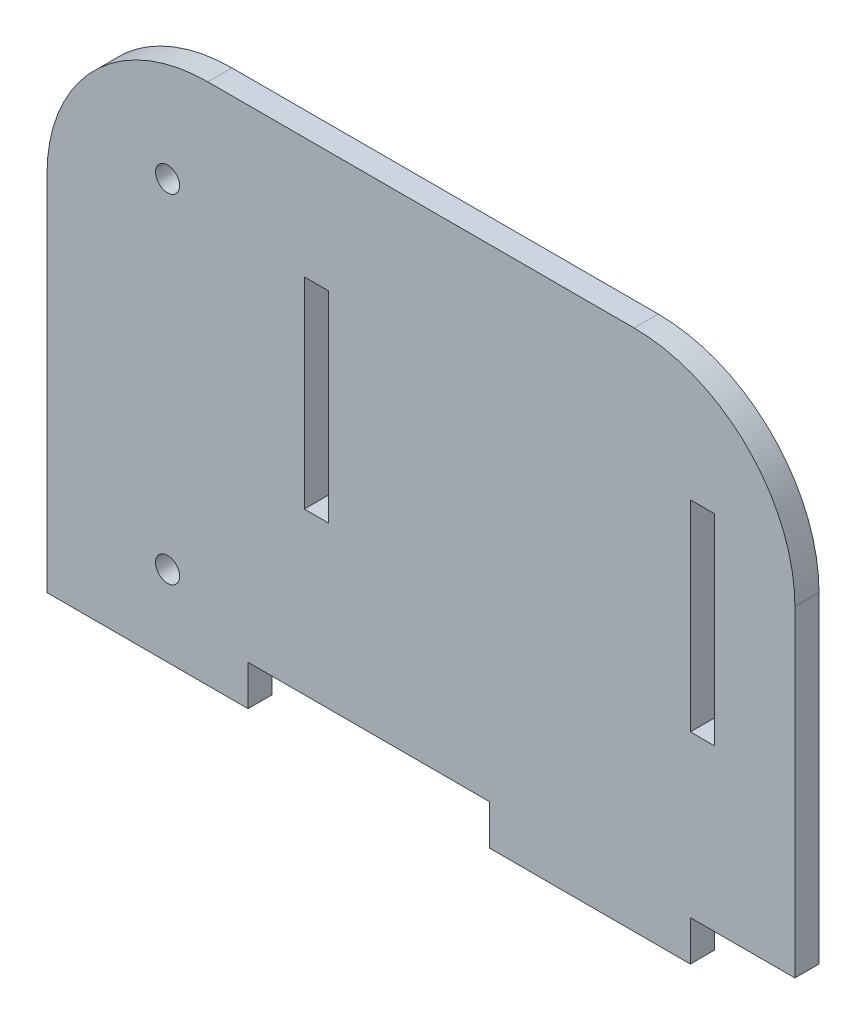
ISO-10303-21;
HEADER;
FILE_DESCRIPTION(('STEP AP214'),'2;1');
FILE_NAME('part.step','',(''),(''),'','','');
FILE_SCHEMA(('AUTOMOTIVE_DESIGN { 1 0 10303 214 1 1 1 1 }'));
ENDSEC;
DATA;
#1=APPLICATION_CONTEXT('core data for automotive mechanical design processes');
#2=APPLICATION_PROTOCOL_DEFINITION('international standard','automotive_design',2000,#1);
#3=PRODUCT_CONTEXT('',#1,'mechanical');
#4=PRODUCT('Part','Part','',(#3));
#5=PRODUCT_RELATED_PRODUCT_CATEGORY('part','',(#4));
#6=PRODUCT_DEFINITION_FORMATION('','',#4);
#7=PRODUCT_DEFINITION_CONTEXT('part definition',#1,'design');
#8=PRODUCT_DEFINITION('design','',#6,#7);
#9=PRODUCT_DEFINITION_SHAPE('','',#8);
#10=(LENGTH_UNIT() NAMED_UNIT(*) SI_UNIT(.MILLI.,.METRE.));
#11=(NAMED_UNIT(*) PLANE_ANGLE_UNIT() SI_UNIT($,.RADIAN.));
#12=(NAMED_UNIT(*) SI_UNIT($,.STERADIAN.) SOLID_ANGLE_UNIT());
#13=UNCERTAINTY_MEASURE_WITH_UNIT(LENGTH_MEASURE(1.E-05),#10,'distance_accuracy_value','');
#14=(GEOMETRIC_REPRESENTATION_CONTEXT(3) GLOBAL_UNCERTAINTY_ASSIGNED_CONTEXT((#13)) GLOBAL_UNIT_ASSIGNED_CONTEXT((#10,
#11,#12)) REPRESENTATION_CONTEXT('',''));
#15=CARTESIAN_POINT('',(0.,0.,0.));
#16=DIRECTION('',(0.,0.,1.));
#17=DIRECTION('',(1.,0.,0.));
#18=AXIS2_PLACEMENT_3D('',#15,#16,#17);
#19=CARTESIAN_POINT('',(56.0400810424611,28.6183048860703,3.));
#20=DIRECTION('',(-1.,0.,0.));
#21=DIRECTION('',(0.,-1.,0.));
#22=AXIS2_PLACEMENT_3D('',#19,#20,#21);
#23=PLANE('',#22);
#24=DIRECTION('',(0.,1.,0.));
#25=VECTOR('',#24,1.);
#26=CARTESIAN_POINT('',(56.0400810424611,28.6183048860703,0.));
#27=LINE('',#26,#25);
#28=CARTESIAN_POINT('',(56.0400810424612,-11.3816951139297,0.));
#29=VERTEX_POINT('',#28);
#30=CARTESIAN_POINT('',(56.0400810424611,28.6183048860703,0.));
#31=VERTEX_POINT('',#30);
#32=EDGE_CURVE('E229',#29,#31,#27,.T.);
#33=ORIENTED_EDGE('',*,*,#32,.T.);
#34=DIRECTION('',(0.,0.,-1.));
#35=VECTOR('',#34,1.);
#36=CARTESIAN_POINT('',(56.0400810424611,28.6183048860703,3.));
#37=LINE('',#36,#35);
#38=CARTESIAN_POINT('',(56.0400810424611,28.6183048860703,3.));
#39=VERTEX_POINT('',#38);
#40=EDGE_CURVE('E313',#39,#31,#37,.T.);
#41=ORIENTED_EDGE('',*,*,#40,.F.);
#42=DIRECTION('',(0.,1.,0.));
#43=VECTOR('',#42,1.);
#44=CARTESIAN_POINT('',(56.0400810424611,28.6183048860703,3.));
#45=LINE('',#44,#43);
#46=CARTESIAN_POINT('',(56.0400810424612,-11.3816951139297,3.));
#47=VERTEX_POINT('',#46);
#48=EDGE_CURVE('E230',#47,#39,#45,.T.);
#49=ORIENTED_EDGE('',*,*,#48,.F.);
#50=DIRECTION('',(0.,0.,-1.));
#51=VECTOR('',#50,1.);
#52=CARTESIAN_POINT('',(56.0400810424612,-11.3816951139297,3.));
#53=LINE('',#52,#51);
#54=EDGE_CURVE('E256',#47,#29,#53,.T.);
#55=ORIENTED_EDGE('',*,*,#54,.T.);
#56=EDGE_LOOP('',(#33,#41,#49,#55));
#57=FACE_BOUND('',#56,.T.);
#58=ADVANCED_FACE('F33',(#57),#23,.F.);
#59=CARTESIAN_POINT('',(36.0400810424611,28.6183048860703,3.));
#60=DIRECTION('',(0.,0.,-1.));
#61=DIRECTION('',(-1.,0.,0.));
#62=AXIS2_PLACEMENT_3D('',#59,#60,#61);
#63=CYLINDRICAL_SURFACE('',#62,20.);
#64=CARTESIAN_POINT('',(36.0400810424611,28.6183048860703,0.));
#65=DIRECTION('',(0.,0.,1.));
#66=DIRECTION('',(-1.,0.,0.));
#67=AXIS2_PLACEMENT_3D('',#64,#65,#66);
#68=CIRCLE('',#67,20.);
#69=CARTESIAN_POINT('',(36.0400810424611,48.6183048860703,0.));
#70=VERTEX_POINT('',#69);
#71=EDGE_CURVE('E259',#31,#70,#68,.T.);
#72=ORIENTED_EDGE('',*,*,#71,.T.);
#73=DIRECTION('',(0.,0.,-1.));
#74=VECTOR('',#73,1.);
#75=CARTESIAN_POINT('',(36.0400810424611,48.6183048860703,3.));
#76=LINE('',#75,#74);
#77=CARTESIAN_POINT('',(36.0400810424611,48.6183048860703,3.));
#78=VERTEX_POINT('',#77);
#79=EDGE_CURVE('E310',#78,#70,#76,.T.);
#80=ORIENTED_EDGE('',*,*,#79,.F.);
#81=CARTESIAN_POINT('',(36.0400810424611,28.6183048860703,3.));
#82=DIRECTION('',(0.,0.,1.));
#83=DIRECTION('',(-1.,0.,0.));
#84=AXIS2_PLACEMENT_3D('',#81,#82,#83);
#85=CIRCLE('',#84,20.);
#86=EDGE_CURVE('E233',#39,#78,#85,.T.);
#87=ORIENTED_EDGE('',*,*,#86,.F.);
#88=ORIENTED_EDGE('',*,*,#40,.T.);
#89=EDGE_LOOP('',(#72,#80,#87,#88));
#90=FACE_BOUND('',#89,.T.);
#91=ADVANCED_FACE('F352',(#90),#63,.T.);
#92=CARTESIAN_POINT('',(-16.9599189575389,48.6183048860703,3.));
#93=DIRECTION('',(0.,-1.,0.));
#94=DIRECTION('',(1.,0.,0.));
#95=AXIS2_PLACEMENT_3D('',#92,#93,#94);
#96=PLANE('',#95);
#97=DIRECTION('',(-1.,0.,0.));
#98=VECTOR('',#97,1.);
#99=CARTESIAN_POINT('',(-16.9599189575389,48.6183048860703,0.));
#100=LINE('',#99,#98);
#101=CARTESIAN_POINT('',(-16.9599189575389,48.6183048860703,0.));
#102=VERTEX_POINT('',#101);
#103=EDGE_CURVE('E261',#70,#102,#100,.T.);
#104=ORIENTED_EDGE('',*,*,#103,.T.);
#105=DIRECTION('',(0.,0.,-1.));
#106=VECTOR('',#105,1.);
#107=CARTESIAN_POINT('',(-16.9599189575389,48.6183048860703,3.));
#108=LINE('',#107,#106);
#109=CARTESIAN_POINT('',(-16.9599189575389,48.6183048860703,3.));
#110=VERTEX_POINT('',#109);
#111=EDGE_CURVE('E307',#110,#102,#108,.T.);
#112=ORIENTED_EDGE('',*,*,#111,.F.);
#113=DIRECTION('',(-1.,0.,0.));
#114=VECTOR('',#113,1.);
#115=CARTESIAN_POINT('',(-16.9599189575389,48.6183048860703,3.));
#116=LINE('',#115,#114);
#117=EDGE_CURVE('E236',#78,#110,#116,.T.);
#118=ORIENTED_EDGE('',*,*,#117,.F.);
#119=ORIENTED_EDGE('',*,*,#79,.T.);
#120=EDGE_LOOP('',(#104,#112,#118,#119));
#121=FACE_BOUND('',#120,.T.);
#122=ADVANCED_FACE('F357',(#121),#96,.F.);
#123=CARTESIAN_POINT('',(-16.9599189575389,28.6183048860703,3.));
#124=DIRECTION('',(0.,0.,-1.));
#125=DIRECTION('',(-1.,0.,0.));
#126=AXIS2_PLACEMENT_3D('',#123,#124,#125);
#127=CYLINDRICAL_SURFACE('',#126,20.);
#128=CARTESIAN_POINT('',(-16.9599189575389,28.6183048860703,0.));
#129=DIRECTION('',(0.,0.,1.));
#130=DIRECTION('',(1.,0.,0.));
#131=AXIS2_PLACEMENT_3D('',#128,#129,#130);
#132=CIRCLE('',#131,20.);
#133=CARTESIAN_POINT('',(-36.9599189575389,28.6183048860703,0.));
#134=VERTEX_POINT('',#133);
#135=EDGE_CURVE('E263',#102,#134,#132,.T.);
#136=ORIENTED_EDGE('',*,*,#135,.T.);
#137=DIRECTION('',(0.,0.,-1.));
#138=VECTOR('',#137,1.);
#139=CARTESIAN_POINT('',(-36.9599189575389,28.6183048860703,3.));
#140=LINE('',#139,#138);
#141=CARTESIAN_POINT('',(-36.9599189575389,28.6183048860703,3.));
#142=VERTEX_POINT('',#141);
#143=EDGE_CURVE('E304',#142,#134,#140,.T.);
#144=ORIENTED_EDGE('',*,*,#143,.F.);
#145=CARTESIAN_POINT('',(-16.9599189575389,28.6183048860703,3.));
#146=DIRECTION('',(0.,0.,1.));
#147=DIRECTION('',(1.,0.,0.));
#148=AXIS2_PLACEMENT_3D('',#145,#146,#147);
#149=CIRCLE('',#148,20.);
#150=EDGE_CURVE('E238',#110,#142,#149,.T.);
#151=ORIENTED_EDGE('',*,*,#150,.F.);
#152=ORIENTED_EDGE('',*,*,#111,.T.);
#153=EDGE_LOOP('',(#136,#144,#151,#152));
#154=FACE_BOUND('',#153,.T.);
#155=ADVANCED_FACE('F409',(#154),#127,.T.);
#156=CARTESIAN_POINT('',(-36.9599189575388,-1.38169511392967,3.));
#157=DIRECTION('',(1.,0.,0.));
#158=DIRECTION('',(0.,1.,0.));
#159=AXIS2_PLACEMENT_3D('',#156,#157,#158);
#160=PLANE('',#159);
#161=DIRECTION('',(0.,-1.,0.));
#162=VECTOR('',#161,1.);
#163=CARTESIAN_POINT('',(-36.9599189575388,-1.38169511392967,0.));
#164=LINE('',#163,#162);
#165=CARTESIAN_POINT('',(-36.9599189575388,-16.3816951139297,0.));
#166=VERTEX_POINT('',#165);
#167=EDGE_CURVE('E266',#134,#166,#164,.T.);
#168=ORIENTED_EDGE('',*,*,#167,.T.);
#169=DIRECTION('',(0.,0.,-1.));
#170=VECTOR('',#169,1.);
#171=CARTESIAN_POINT('',(-36.9599189575388,-16.3816951139297,3.));
#172=LINE('',#171,#170);
#173=CARTESIAN_POINT('',(-36.9599189575388,-16.3816951139297,3.));
#174=VERTEX_POINT('',#173);
#175=EDGE_CURVE('E301',#174,#166,#172,.T.);
#176=ORIENTED_EDGE('',*,*,#175,.F.);
#177=DIRECTION('',(0.,-1.,0.));
#178=VECTOR('',#177,1.);
#179=CARTESIAN_POINT('',(-36.9599189575389,28.6183048860703,3.));
#180=LINE('',#179,#178);
#181=EDGE_CURVE('E240',#142,#174,#180,.T.);
#182=ORIENTED_EDGE('',*,*,#181,.F.);
#183=ORIENTED_EDGE('',*,*,#143,.T.);
#184=EDGE_LOOP('',(#168,#176,#182,#183));
#185=FACE_BOUND('',#184,.T.);
#186=ADVANCED_FACE('F406',(#185),#160,.F.);
#187=CARTESIAN_POINT('',(-36.9599189575388,-16.3816951139297,3.));
#188=DIRECTION('',(0.,1.,0.));
#189=DIRECTION('',(0.,0.,1.));
#190=AXIS2_PLACEMENT_3D('',#187,#188,#189);
#191=PLANE('',#190);
#192=DIRECTION('',(1.,0.,0.));
#193=VECTOR('',#192,1.);
#194=CARTESIAN_POINT('',(-36.9599189575388,-16.3816951139297,0.));
#195=LINE('',#194,#193);
#196=CARTESIAN_POINT('',(-11.9599189575388,-16.3816951139297,0.));
#197=VERTEX_POINT('',#196);
#198=EDGE_CURVE('E268',#166,#197,#195,.T.);
#199=ORIENTED_EDGE('',*,*,#198,.T.);
#200=DIRECTION('',(0.,0.,-1.));
#201=VECTOR('',#200,1.);
#202=CARTESIAN_POINT('',(-11.9599189575388,-16.3816951139297,3.));
#203=LINE('',#202,#201);
#204=CARTESIAN_POINT('',(-11.9599189575388,-16.3816951139297,3.));
#205=VERTEX_POINT('',#204);
#206=EDGE_CURVE('E298',#205,#197,#203,.T.);
#207=ORIENTED_EDGE('',*,*,#206,.F.);
#208=DIRECTION('',(1.,0.,0.));
#209=VECTOR('',#208,1.);
#210=CARTESIAN_POINT('',(-36.9599189575388,-16.3816951139297,3.));
#211=LINE('',#210,#209);
#212=EDGE_CURVE('E242',#174,#205,#211,.T.);
#213=ORIENTED_EDGE('',*,*,#212,.F.);
#214=ORIENTED_EDGE('',*,*,#175,.T.);
#215=EDGE_LOOP('',(#199,#207,#213,#214));
#216=FACE_BOUND('',#215,.T.);
#217=ADVANCED_FACE('F402',(#216),#191,.F.);
#218=CARTESIAN_POINT('',(-11.9599189575388,-11.3816951139297,3.));
#219=DIRECTION('',(-1.,0.,0.));
#220=DIRECTION('',(0.,-1.,0.));
#221=AXIS2_PLACEMENT_3D('',#218,#219,#220);
#222=PLANE('',#221);
#223=DIRECTION('',(0.,1.,0.));
#224=VECTOR('',#223,1.);
#225=CARTESIAN_POINT('',(-11.9599189575388,-11.3816951139297,0.));
#226=LINE('',#225,#224);
#227=CARTESIAN_POINT('',(-11.9599189575388,-11.3816951139297,0.));
#228=VERTEX_POINT('',#227);
#229=EDGE_CURVE('E270',#197,#228,#226,.T.);
#230=ORIENTED_EDGE('',*,*,#229,.T.);
#231=DIRECTION('',(0.,0.,-1.));
#232=VECTOR('',#231,1.);
#233=CARTESIAN_POINT('',(-11.9599189575388,-11.3816951139297,3.));
#234=LINE('',#233,#232);
#235=CARTESIAN_POINT('',(-11.9599189575388,-11.3816951139297,3.));
#236=VERTEX_POINT('',#235);
#237=EDGE_CURVE('E295',#236,#228,#234,.T.);
#238=ORIENTED_EDGE('',*,*,#237,.F.);
#239=DIRECTION('',(0.,1.,0.));
#240=VECTOR('',#239,1.);
#241=CARTESIAN_POINT('',(-11.9599189575388,-11.3816951139297,3.));
#242=LINE('',#241,#240);
#243=EDGE_CURVE('E244',#205,#236,#242,.T.);
#244=ORIENTED_EDGE('',*,*,#243,.F.);
#245=ORIENTED_EDGE('',*,*,#206,.T.);
#246=EDGE_LOOP('',(#230,#238,#244,#245));
#247=FACE_BOUND('',#246,.T.);
#248=ADVANCED_FACE('F397',(#247),#222,.F.);
#249=CARTESIAN_POINT('',(-11.9599189575388,-11.3816951139297,3.));
#250=DIRECTION('',(0.,1.,0.));
#251=DIRECTION('',(0.,0.,1.));
#252=AXIS2_PLACEMENT_3D('',#249,#250,#251);
#253=PLANE('',#252);
#254=DIRECTION('',(1.,0.,0.));
#255=VECTOR('',#254,1.);
#256=CARTESIAN_POINT('',(-11.9599189575388,-11.3816951139297,0.));
#257=LINE('',#256,#255);
#258=CARTESIAN_POINT('',(18.0400810424612,-11.3816951139297,0.));
#259=VERTEX_POINT('',#258);
#260=EDGE_CURVE('E272',#228,#259,#257,.T.);
#261=ORIENTED_EDGE('',*,*,#260,.T.);
#262=DIRECTION('',(0.,0.,-1.));
#263=VECTOR('',#262,1.);
#264=CARTESIAN_POINT('',(18.0400810424612,-11.3816951139297,3.));
#265=LINE('',#264,#263);
#266=CARTESIAN_POINT('',(18.0400810424612,-11.3816951139297,3.));
#267=VERTEX_POINT('',#266);
#268=EDGE_CURVE('E292',#267,#259,#265,.T.);
#269=ORIENTED_EDGE('',*,*,#268,.F.);
#270=DIRECTION('',(1.,0.,0.));
#271=VECTOR('',#270,1.);
#272=CARTESIAN_POINT('',(-11.9599189575388,-11.3816951139297,3.));
#273=LINE('',#272,#271);
#274=EDGE_CURVE('E246',#236,#267,#273,.T.);
#275=ORIENTED_EDGE('',*,*,#274,.F.);
#276=ORIENTED_EDGE('',*,*,#237,.T.);
#277=EDGE_LOOP('',(#261,#269,#275,#276));
#278=FACE_BOUND('',#277,.T.);
#279=ADVANCED_FACE('F392',(#278),#253,.F.);
#280=CARTESIAN_POINT('',(18.0400810424612,-11.3816951139297,3.));
#281=DIRECTION('',(1.,0.,0.));
#282=DIRECTION('',(0.,1.,0.));
#283=AXIS2_PLACEMENT_3D('',#280,#281,#282);
#284=PLANE('',#283);
#285=DIRECTION('',(0.,-1.,0.));
#286=VECTOR('',#285,1.);
#287=CARTESIAN_POINT('',(18.0400810424612,-11.3816951139297,0.));
#288=LINE('',#287,#286);
#289=CARTESIAN_POINT('',(18.0400810424612,-16.3816951139297,0.));
#290=VERTEX_POINT('',#289);
#291=EDGE_CURVE('E274',#259,#290,#288,.T.);
#292=ORIENTED_EDGE('',*,*,#291,.T.);
#293=DIRECTION('',(0.,0.,-1.));
#294=VECTOR('',#293,1.);
#295=CARTESIAN_POINT('',(18.0400810424612,-16.3816951139297,3.));
#296=LINE('',#295,#294);
#297=CARTESIAN_POINT('',(18.0400810424612,-16.3816951139297,3.));
#298=VERTEX_POINT('',#297);
#299=EDGE_CURVE('E289',#298,#290,#296,.T.);
#300=ORIENTED_EDGE('',*,*,#299,.F.);
#301=DIRECTION('',(0.,-1.,0.));
#302=VECTOR('',#301,1.);
#303=CARTESIAN_POINT('',(18.0400810424612,-11.3816951139297,3.));
#304=LINE('',#303,#302);
#305=EDGE_CURVE('E248',#267,#298,#304,.T.);
#306=ORIENTED_EDGE('',*,*,#305,.F.);
#307=ORIENTED_EDGE('',*,*,#268,.T.);
#308=EDGE_LOOP('',(#292,#300,#306,#307));
#309=FACE_BOUND('',#308,.T.);
#310=ADVANCED_FACE('F388',(#309),#284,.F.);
#311=CARTESIAN_POINT('',(18.0400810424612,-16.3816951139297,3.));
#312=DIRECTION('',(0.,1.,0.));
#313=DIRECTION('',(-1.,0.,0.));
#314=AXIS2_PLACEMENT_3D('',#311,#312,#313);
#315=PLANE('',#314);
#316=DIRECTION('',(1.,0.,0.));
#317=VECTOR('',#316,1.);
#318=CARTESIAN_POINT('',(18.0400810424612,-16.3816951139297,0.));
#319=LINE('',#318,#317);
#320=CARTESIAN_POINT('',(43.0400810424612,-16.3816951139297,0.));
#321=VERTEX_POINT('',#320);
#322=EDGE_CURVE('E276',#290,#321,#319,.T.);
#323=ORIENTED_EDGE('',*,*,#322,.T.);
#324=DIRECTION('',(0.,0.,-1.));
#325=VECTOR('',#324,1.);
#326=CARTESIAN_POINT('',(43.0400810424612,-16.3816951139297,3.));
#327=LINE('',#326,#325);
#328=CARTESIAN_POINT('',(43.0400810424612,-16.3816951139297,3.));
#329=VERTEX_POINT('',#328);
#330=EDGE_CURVE('E286',#329,#321,#327,.T.);
#331=ORIENTED_EDGE('',*,*,#330,.F.);
#332=DIRECTION('',(1.,0.,0.));
#333=VECTOR('',#332,1.);
#334=CARTESIAN_POINT('',(18.0400810424612,-16.3816951139297,3.));
#335=LINE('',#334,#333);
#336=EDGE_CURVE('E250',#298,#329,#335,.T.);
#337=ORIENTED_EDGE('',*,*,#336,.F.);
#338=ORIENTED_EDGE('',*,*,#299,.T.);
#339=EDGE_LOOP('',(#323,#331,#337,#338));
#340=FACE_BOUND('',#339,.T.);
#341=ADVANCED_FACE('F383',(#340),#315,.F.);
#342=CARTESIAN_POINT('',(43.0400810424612,-11.3816951139297,3.));
#343=DIRECTION('',(-1.,0.,0.));
#344=DIRECTION('',(0.,0.,1.));
#345=AXIS2_PLACEMENT_3D('',#342,#343,#344);
#346=PLANE('',#345);
#347=DIRECTION('',(0.,1.,0.));
#348=VECTOR('',#347,1.);
#349=CARTESIAN_POINT('',(43.0400810424612,-11.3816951139297,0.));
#350=LINE('',#349,#348);
#351=CARTESIAN_POINT('',(43.0400810424612,-11.3816951139297,0.));
#352=VERTEX_POINT('',#351);
#353=EDGE_CURVE('E278',#321,#352,#350,.T.);
#354=ORIENTED_EDGE('',*,*,#353,.T.);
#355=DIRECTION('',(0.,0.,-1.));
#356=VECTOR('',#355,1.);
#357=CARTESIAN_POINT('',(43.0400810424612,-11.3816951139297,3.));
#358=LINE('',#357,#356);
#359=CARTESIAN_POINT('',(43.0400810424612,-11.3816951139297,3.));
#360=VERTEX_POINT('',#359);
#361=EDGE_CURVE('E283',#360,#352,#358,.T.);
#362=ORIENTED_EDGE('',*,*,#361,.F.);
#363=DIRECTION('',(0.,1.,0.));
#364=VECTOR('',#363,1.);
#365=CARTESIAN_POINT('',(43.0400810424612,-11.3816951139297,3.));
#366=LINE('',#365,#364);
#367=EDGE_CURVE('E252',#329,#360,#366,.T.);
#368=ORIENTED_EDGE('',*,*,#367,.F.);
#369=ORIENTED_EDGE('',*,*,#330,.T.);
#370=EDGE_LOOP('',(#354,#362,#368,#369));
#371=FACE_BOUND('',#370,.T.);
#372=ADVANCED_FACE('F377',(#371),#346,.F.);
#373=CARTESIAN_POINT('',(43.0400810424612,-11.3816951139297,3.));
#374=DIRECTION('',(0.,1.,0.));
#375=DIRECTION('',(0.,0.,1.));
#376=AXIS2_PLACEMENT_3D('',#373,#374,#375);
#377=PLANE('',#376);
#378=DIRECTION('',(1.,0.,0.));
#379=VECTOR('',#378,1.);
#380=CARTESIAN_POINT('',(43.0400810424612,-11.3816951139297,0.));
#381=LINE('',#380,#379);
#382=EDGE_CURVE('E234',#352,#29,#381,.T.);
#383=ORIENTED_EDGE('',*,*,#382,.T.);
#384=ORIENTED_EDGE('',*,*,#54,.F.);
#385=DIRECTION('',(1.,0.,0.));
#386=VECTOR('',#385,1.);
#387=CARTESIAN_POINT('',(43.0400810424612,-11.3816951139297,3.));
#388=LINE('',#387,#386);
#389=EDGE_CURVE('E254',#360,#47,#388,.T.);
#390=ORIENTED_EDGE('',*,*,#389,.F.);
#391=ORIENTED_EDGE('',*,*,#361,.T.);
#392=EDGE_LOOP('',(#383,#384,#390,#391));
#393=FACE_BOUND('',#392,.T.);
#394=ADVANCED_FACE('F375',(#393),#377,.F.);
#395=CARTESIAN_POINT('',(-16.9599189575389,28.6183048860703,3.));
#396=DIRECTION('',(0.,0.,1.));
#397=DIRECTION('',(1.,0.,0.));
#398=AXIS2_PLACEMENT_3D('',#395,#396,#397);
#399=PLANE('',#398);
#400=DIRECTION('',(0.,-1.,0.));
#401=VECTOR('',#400,1.);
#402=CARTESIAN_POINT('',(43.0400810424611,33.6183048860703,3.));
#403=LINE('',#402,#401);
#404=CARTESIAN_POINT('',(43.0400810424611,33.6183048860703,3.));
#405=VERTEX_POINT('',#404);
#406=CARTESIAN_POINT('',(43.0400810424611,8.61830488607035,3.));
#407=VERTEX_POINT('',#406);
#408=EDGE_CURVE('E47',#405,#407,#403,.T.);
#409=ORIENTED_EDGE('',*,*,#408,.F.);
#410=DIRECTION('',(-1.,0.,0.));
#411=VECTOR('',#410,1.);
#412=CARTESIAN_POINT('',(43.0400810424611,33.6183048860703,3.));
#413=LINE('',#412,#411);
#414=CARTESIAN_POINT('',(46.0400810424611,33.6183048860703,3.));
#415=VERTEX_POINT('',#414);
#416=EDGE_CURVE('E188',#415,#405,#413,.T.);
#417=ORIENTED_EDGE('',*,*,#416,.F.);
#418=DIRECTION('',(0.,1.,0.));
#419=VECTOR('',#418,1.);
#420=CARTESIAN_POINT('',(46.0400810424611,33.6183048860703,3.));
#421=LINE('',#420,#419);
#422=CARTESIAN_POINT('',(46.0400810424611,8.61830488607035,3.));
#423=VERTEX_POINT('',#422);
#424=EDGE_CURVE('E172',#423,#415,#421,.T.);
#425=ORIENTED_EDGE('',*,*,#424,.F.);
#426=DIRECTION('',(1.,0.,0.));
#427=VECTOR('',#426,1.);
#428=CARTESIAN_POINT('',(43.0400810424611,8.61830488607035,3.));
#429=LINE('',#428,#427);
#430=EDGE_CURVE('E181',#407,#423,#429,.T.);
#431=ORIENTED_EDGE('',*,*,#430,.F.);
#432=EDGE_LOOP('',(#409,#417,#425,#431));
#433=FACE_BOUND('',#432,.T.);
#434=DIRECTION('',(0.,-1.,0.));
#435=VECTOR('',#434,1.);
#436=CARTESIAN_POINT('',(-4.95991895753886,33.6183048860703,3.));
#437=LINE('',#436,#435);
#438=CARTESIAN_POINT('',(-4.95991895753886,33.6183048860703,3.));
#439=VERTEX_POINT('',#438);
#440=CARTESIAN_POINT('',(-4.95991895753886,8.61830488607033,3.));
#441=VERTEX_POINT('',#440);
#442=EDGE_CURVE('E195',#439,#441,#437,.T.);
#443=ORIENTED_EDGE('',*,*,#442,.F.);
#444=DIRECTION('',(-1.,0.,0.));
#445=VECTOR('',#444,1.);
#446=CARTESIAN_POINT('',(-4.95991895753886,33.6183048860703,3.));
#447=LINE('',#446,#445);
#448=CARTESIAN_POINT('',(-1.95991895753886,33.6183048860703,3.));
#449=VERTEX_POINT('',#448);
#450=EDGE_CURVE('E205',#449,#439,#447,.T.);
#451=ORIENTED_EDGE('',*,*,#450,.F.);
#452=DIRECTION('',(0.,1.,0.));
#453=VECTOR('',#452,1.);
#454=CARTESIAN_POINT('',(-1.95991895753886,33.6183048860703,3.));
#455=LINE('',#454,#453);
#456=CARTESIAN_POINT('',(-1.95991895753886,8.61830488607033,3.));
#457=VERTEX_POINT('',#456);
#458=EDGE_CURVE('E202',#457,#449,#455,.T.);
#459=ORIENTED_EDGE('',*,*,#458,.F.);
#460=DIRECTION('',(1.,0.,0.));
#461=VECTOR('',#460,1.);
#462=CARTESIAN_POINT('',(-4.95991895753886,8.61830488607033,3.));
#463=LINE('',#462,#461);
#464=EDGE_CURVE('E199',#441,#457,#463,.T.);
#465=ORIENTED_EDGE('',*,*,#464,.F.);
#466=EDGE_LOOP('',(#443,#451,#459,#465));
#467=FACE_BOUND('',#466,.T.);
#468=CARTESIAN_POINT('',(-21.9599189575389,-6.38169511392967,3.));
#469=DIRECTION('',(0.,0.,1.));
#470=DIRECTION('',(1.,0.,0.));
#471=AXIS2_PLACEMENT_3D('',#468,#469,#470);
#472=CIRCLE('',#471,1.5);
#473=CARTESIAN_POINT('',(-20.4599189575389,-6.38169511392967,3.));
#474=VERTEX_POINT('',#473);
#475=EDGE_CURVE('E220',#474,#474,#472,.T.);
#476=ORIENTED_EDGE('',*,*,#475,.F.);
#477=EDGE_LOOP('',(#476));
#478=FACE_BOUND('',#477,.T.);
#479=CARTESIAN_POINT('',(-21.9599189575389,35.6683048860703,3.));
#480=DIRECTION('',(0.,0.,1.));
#481=DIRECTION('',(1.,0.,0.));
#482=AXIS2_PLACEMENT_3D('',#479,#480,#481);
#483=CIRCLE('',#482,1.5);
#484=CARTESIAN_POINT('',(-20.4599189575389,35.6683048860703,3.));
#485=VERTEX_POINT('',#484);
#486=EDGE_CURVE('E226',#485,#485,#483,.T.);
#487=ORIENTED_EDGE('',*,*,#486,.F.);
#488=EDGE_LOOP('',(#487));
#489=FACE_BOUND('',#488,.T.);
#490=ORIENTED_EDGE('',*,*,#48,.T.);
#491=ORIENTED_EDGE('',*,*,#86,.T.);
#492=ORIENTED_EDGE('',*,*,#117,.T.);
#493=ORIENTED_EDGE('',*,*,#150,.T.);
#494=ORIENTED_EDGE('',*,*,#181,.T.);
#495=ORIENTED_EDGE('',*,*,#212,.T.);
#496=ORIENTED_EDGE('',*,*,#243,.T.);
#497=ORIENTED_EDGE('',*,*,#274,.T.);
#498=ORIENTED_EDGE('',*,*,#305,.T.);
#499=ORIENTED_EDGE('',*,*,#336,.T.);
#500=ORIENTED_EDGE('',*,*,#367,.T.);
#501=ORIENTED_EDGE('',*,*,#389,.T.);
#502=EDGE_LOOP('',(#490,#491,#492,#493,#494,#495,#496,#497,#498,#499,#500,#501));
#503=FACE_BOUND('',#502,.T.);
#504=ADVANCED_FACE('F185',(#433,#467,#478,#489,#503),#399,.T.);
#505=CARTESIAN_POINT('',(-16.9599189575389,28.6183048860703,0.));
#506=DIRECTION('',(0.,0.,1.));
#507=DIRECTION('',(1.,0.,0.));
#508=AXIS2_PLACEMENT_3D('',#505,#506,#507);
#509=PLANE('',#508);
#510=DIRECTION('',(-1.,0.,0.));
#511=VECTOR('',#510,1.);
#512=CARTESIAN_POINT('',(-16.9599189575389,33.6183048860703,0.));
#513=LINE('',#512,#511);
#514=CARTESIAN_POINT('',(46.0400810424611,33.6183048860703,0.));
#515=VERTEX_POINT('',#514);
#516=CARTESIAN_POINT('',(43.0400810424611,33.6183048860703,0.));
#517=VERTEX_POINT('',#516);
#518=EDGE_CURVE('E40',#515,#517,#513,.T.);
#519=ORIENTED_EDGE('',*,*,#518,.T.);
#520=DIRECTION('',(0.,-1.,0.));
#521=VECTOR('',#520,1.);
#522=CARTESIAN_POINT('',(43.0400810424611,28.6183048860703,0.));
#523=LINE('',#522,#521);
#524=CARTESIAN_POINT('',(43.0400810424611,8.61830488607035,0.));
#525=VERTEX_POINT('',#524);
#526=EDGE_CURVE('E11',#517,#525,#523,.T.);
#527=ORIENTED_EDGE('',*,*,#526,.T.);
#528=DIRECTION('',(1.,0.,0.));
#529=VECTOR('',#528,1.);
#530=CARTESIAN_POINT('',(-16.9599189575389,8.61830488607035,0.));
#531=LINE('',#530,#529);
#532=CARTESIAN_POINT('',(46.0400810424611,8.61830488607035,0.));
#533=VERTEX_POINT('',#532);
#534=EDGE_CURVE('E328',#525,#533,#531,.T.);
#535=ORIENTED_EDGE('',*,*,#534,.T.);
#536=DIRECTION('',(0.,1.,0.));
#537=VECTOR('',#536,1.);
#538=CARTESIAN_POINT('',(46.0400810424611,28.6183048860703,0.));
#539=LINE('',#538,#537);
#540=EDGE_CURVE('E175',#533,#515,#539,.T.);
#541=ORIENTED_EDGE('',*,*,#540,.T.);
#542=EDGE_LOOP('',(#519,#527,#535,#541));
#543=FACE_BOUND('',#542,.T.);
#544=DIRECTION('',(-1.,0.,0.));
#545=VECTOR('',#544,1.);
#546=CARTESIAN_POINT('',(-16.9599189575389,33.6183048860703,0.));
#547=LINE('',#546,#545);
#548=CARTESIAN_POINT('',(-1.95991895753886,33.6183048860703,0.));
#549=VERTEX_POINT('',#548);
#550=CARTESIAN_POINT('',(-4.95991895753886,33.6183048860703,0.));
#551=VERTEX_POINT('',#550);
#552=EDGE_CURVE('E322',#549,#551,#547,.T.);
#553=ORIENTED_EDGE('',*,*,#552,.T.);
#554=DIRECTION('',(0.,-1.,0.));
#555=VECTOR('',#554,1.);
#556=CARTESIAN_POINT('',(-4.95991895753886,28.6183048860703,0.));
#557=LINE('',#556,#555);
#558=CARTESIAN_POINT('',(-4.95991895753886,8.61830488607033,0.));
#559=VERTEX_POINT('',#558);
#560=EDGE_CURVE('E325',#551,#559,#557,.T.);
#561=ORIENTED_EDGE('',*,*,#560,.T.);
#562=DIRECTION('',(1.,0.,0.));
#563=VECTOR('',#562,1.);
#564=CARTESIAN_POINT('',(-16.9599189575389,8.61830488607033,0.));
#565=LINE('',#564,#563);
#566=CARTESIAN_POINT('',(-1.95991895753886,8.61830488607033,0.));
#567=VERTEX_POINT('',#566);
#568=EDGE_CURVE('E316',#559,#567,#565,.T.);
#569=ORIENTED_EDGE('',*,*,#568,.T.);
#570=DIRECTION('',(0.,1.,0.));
#571=VECTOR('',#570,1.);
#572=CARTESIAN_POINT('',(-1.95991895753886,28.6183048860703,0.));
#573=LINE('',#572,#571);
#574=EDGE_CURVE('E319',#567,#549,#573,.T.);
#575=ORIENTED_EDGE('',*,*,#574,.T.);
#576=EDGE_LOOP('',(#553,#561,#569,#575));
#577=FACE_BOUND('',#576,.T.);
#578=CARTESIAN_POINT('',(-21.9599189575389,-6.38169511392967,0.));
#579=DIRECTION('',(0.,0.,-1.));
#580=DIRECTION('',(-1.,0.,0.));
#581=AXIS2_PLACEMENT_3D('',#578,#579,#580);
#582=CIRCLE('',#581,1.5);
#583=CARTESIAN_POINT('',(-23.4599189575389,-6.38169511392967,0.));
#584=VERTEX_POINT('',#583);
#585=EDGE_CURVE('E211',#584,#584,#582,.T.);
#586=ORIENTED_EDGE('',*,*,#585,.F.);
#587=EDGE_LOOP('',(#586));
#588=FACE_BOUND('',#587,.T.);
#589=CARTESIAN_POINT('',(-21.9599189575389,35.6683048860703,0.));
#590=DIRECTION('',(0.,0.,-1.));
#591=DIRECTION('',(-1.,0.,0.));
#592=AXIS2_PLACEMENT_3D('',#589,#590,#591);
#593=CIRCLE('',#592,1.5);
#594=CARTESIAN_POINT('',(-23.4599189575389,35.6683048860703,0.));
#595=VERTEX_POINT('',#594);
#596=EDGE_CURVE('E223',#595,#595,#593,.T.);
#597=ORIENTED_EDGE('',*,*,#596,.F.);
#598=EDGE_LOOP('',(#597));
#599=FACE_BOUND('',#598,.T.);
#600=ORIENTED_EDGE('',*,*,#32,.F.);
#601=ORIENTED_EDGE('',*,*,#382,.F.);
#602=ORIENTED_EDGE('',*,*,#353,.F.);
#603=ORIENTED_EDGE('',*,*,#322,.F.);
#604=ORIENTED_EDGE('',*,*,#291,.F.);
#605=ORIENTED_EDGE('',*,*,#260,.F.);
#606=ORIENTED_EDGE('',*,*,#229,.F.);
#607=ORIENTED_EDGE('',*,*,#198,.F.);
#608=ORIENTED_EDGE('',*,*,#167,.F.);
#609=ORIENTED_EDGE('',*,*,#135,.F.);
#610=ORIENTED_EDGE('',*,*,#103,.F.);
#611=ORIENTED_EDGE('',*,*,#71,.F.);
#612=EDGE_LOOP('',(#600,#601,#602,#603,#604,#605,#606,#607,#608,#609,#610,#611));
#613=FACE_BOUND('',#612,.T.);
#614=ADVANCED_FACE('F332',(#543,#577,#588,#599,#613),#509,.F.);
#615=CARTESIAN_POINT('',(-21.9599189575389,35.6683048860703,10.));
#616=DIRECTION('',(0.,0.,-1.));
#617=DIRECTION('',(-1.,0.,0.));
#618=AXIS2_PLACEMENT_3D('',#615,#616,#617);
#619=CYLINDRICAL_SURFACE('',#618,1.5);
#620=ORIENTED_EDGE('',*,*,#486,.T.);
#621=EDGE_LOOP('',(#620));
#622=FACE_BOUND('',#621,.T.);
#623=ORIENTED_EDGE('',*,*,#596,.T.);
#624=EDGE_LOOP('',(#623));
#625=FACE_BOUND('',#624,.T.);
#626=ADVANCED_FACE('F438',(#622,#625),#619,.F.);
#627=CARTESIAN_POINT('',(-21.9599189575389,-6.38169511392967,10.));
#628=DIRECTION('',(0.,0.,-1.));
#629=DIRECTION('',(-1.,0.,0.));
#630=AXIS2_PLACEMENT_3D('',#627,#628,#629);
#631=CYLINDRICAL_SURFACE('',#630,1.5);
#632=ORIENTED_EDGE('',*,*,#475,.T.);
#633=EDGE_LOOP('',(#632));
#634=FACE_BOUND('',#633,.T.);
#635=ORIENTED_EDGE('',*,*,#585,.T.);
#636=EDGE_LOOP('',(#635));
#637=FACE_BOUND('',#636,.T.);
#638=ADVANCED_FACE('F443',(#634,#637),#631,.F.);
#639=CARTESIAN_POINT('',(-4.95991895753886,33.6183048860703,-7.));
#640=DIRECTION('',(-1.,0.,0.));
#641=DIRECTION('',(0.,-1.,0.));
#642=AXIS2_PLACEMENT_3D('',#639,#640,#641);
#643=PLANE('',#642);
#644=DIRECTION('',(0.,0.,1.));
#645=VECTOR('',#644,1.);
#646=CARTESIAN_POINT('',(-4.95991895753886,33.6183048860703,-7.));
#647=LINE('',#646,#645);
#648=EDGE_CURVE('E209',#551,#439,#647,.T.);
#649=ORIENTED_EDGE('',*,*,#648,.T.);
#650=ORIENTED_EDGE('',*,*,#442,.T.);
#651=DIRECTION('',(0.,0.,1.));
#652=VECTOR('',#651,1.);
#653=CARTESIAN_POINT('',(-4.95991895753886,8.61830488607033,-7.));
#654=LINE('',#653,#652);
#655=EDGE_CURVE('E208',#559,#441,#654,.T.);
#656=ORIENTED_EDGE('',*,*,#655,.F.);
#657=ORIENTED_EDGE('',*,*,#560,.F.);
#658=EDGE_LOOP('',(#649,#650,#656,#657));
#659=FACE_BOUND('',#658,.T.);
#660=ADVANCED_FACE('F447',(#659),#643,.F.);
#661=CARTESIAN_POINT('',(-4.95991895753886,33.6183048860703,-7.));
#662=DIRECTION('',(0.,1.,0.));
#663=DIRECTION('',(0.,0.,1.));
#664=AXIS2_PLACEMENT_3D('',#661,#662,#663);
#665=PLANE('',#664);
#666=DIRECTION('',(0.,0.,1.));
#667=VECTOR('',#666,1.);
#668=CARTESIAN_POINT('',(-1.95991895753886,33.6183048860703,-7.));
#669=LINE('',#668,#667);
#670=EDGE_CURVE('E212',#549,#449,#669,.T.);
#671=ORIENTED_EDGE('',*,*,#670,.T.);
#672=ORIENTED_EDGE('',*,*,#450,.T.);
#673=ORIENTED_EDGE('',*,*,#648,.F.);
#674=ORIENTED_EDGE('',*,*,#552,.F.);
#675=EDGE_LOOP('',(#671,#672,#673,#674));
#676=FACE_BOUND('',#675,.T.);
#677=ADVANCED_FACE('F450',(#676),#665,.F.);
#678=CARTESIAN_POINT('',(-1.95991895753886,33.6183048860703,-7.));
#679=DIRECTION('',(1.,0.,0.));
#680=DIRECTION('',(0.,1.,0.));
#681=AXIS2_PLACEMENT_3D('',#678,#679,#680);
#682=PLANE('',#681);
#683=DIRECTION('',(0.,0.,1.));
#684=VECTOR('',#683,1.);
#685=CARTESIAN_POINT('',(-1.95991895753886,8.61830488607033,-7.));
#686=LINE('',#685,#684);
#687=EDGE_CURVE('E214',#567,#457,#686,.T.);
#688=ORIENTED_EDGE('',*,*,#687,.T.);
#689=ORIENTED_EDGE('',*,*,#458,.T.);
#690=ORIENTED_EDGE('',*,*,#670,.F.);
#691=ORIENTED_EDGE('',*,*,#574,.F.);
#692=EDGE_LOOP('',(#688,#689,#690,#691));
#693=FACE_BOUND('',#692,.T.);
#694=ADVANCED_FACE('F346',(#693),#682,.F.);
#695=CARTESIAN_POINT('',(-4.95991895753886,8.61830488607033,-7.));
#696=DIRECTION('',(0.,-1.,0.));
#697=DIRECTION('',(0.,0.,-1.));
#698=AXIS2_PLACEMENT_3D('',#695,#696,#697);
#699=PLANE('',#698);
#700=ORIENTED_EDGE('',*,*,#655,.T.);
#701=ORIENTED_EDGE('',*,*,#464,.T.);
#702=ORIENTED_EDGE('',*,*,#687,.F.);
#703=ORIENTED_EDGE('',*,*,#568,.F.);
#704=EDGE_LOOP('',(#700,#701,#702,#703));
#705=FACE_BOUND('',#704,.T.);
#706=ADVANCED_FACE('F339',(#705),#699,.F.);
#707=CARTESIAN_POINT('',(43.0400810424611,33.6183048860703,-7.));
#708=DIRECTION('',(-1.,0.,0.));
#709=DIRECTION('',(0.,-1.,0.));
#710=AXIS2_PLACEMENT_3D('',#707,#708,#709);
#711=PLANE('',#710);
#712=DIRECTION('',(0.,0.,1.));
#713=VECTOR('',#712,1.);
#714=CARTESIAN_POINT('',(43.0400810424611,33.6183048860703,-7.));
#715=LINE('',#714,#713);
#716=EDGE_CURVE('E193',#517,#405,#715,.T.);
#717=ORIENTED_EDGE('',*,*,#716,.T.);
#718=ORIENTED_EDGE('',*,*,#408,.T.);
#719=DIRECTION('',(0.,0.,1.));
#720=VECTOR('',#719,1.);
#721=CARTESIAN_POINT('',(43.0400810424611,8.61830488607035,-7.));
#722=LINE('',#721,#720);
#723=EDGE_CURVE('E178',#525,#407,#722,.T.);
#724=ORIENTED_EDGE('',*,*,#723,.F.);
#725=ORIENTED_EDGE('',*,*,#526,.F.);
#726=EDGE_LOOP('',(#717,#718,#724,#725));
#727=FACE_BOUND('',#726,.T.);
#728=ADVANCED_FACE('F337',(#727),#711,.F.);
#729=CARTESIAN_POINT('',(43.0400810424611,33.6183048860703,-7.));
#730=DIRECTION('',(0.,1.,0.));
#731=DIRECTION('',(0.,0.,1.));
#732=AXIS2_PLACEMENT_3D('',#729,#730,#731);
#733=PLANE('',#732);
#734=DIRECTION('',(0.,0.,1.));
#735=VECTOR('',#734,1.);
#736=CARTESIAN_POINT('',(46.0400810424611,33.6183048860703,-7.));
#737=LINE('',#736,#735);
#738=EDGE_CURVE('E177',#515,#415,#737,.T.);
#739=ORIENTED_EDGE('',*,*,#738,.T.);
#740=ORIENTED_EDGE('',*,*,#416,.T.);
#741=ORIENTED_EDGE('',*,*,#716,.F.);
#742=ORIENTED_EDGE('',*,*,#518,.F.);
#743=EDGE_LOOP('',(#739,#740,#741,#742));
#744=FACE_BOUND('',#743,.T.);
#745=ADVANCED_FACE('F336',(#744),#733,.F.);
#746=CARTESIAN_POINT('',(46.0400810424611,33.6183048860703,-7.));
#747=DIRECTION('',(1.,0.,0.));
#748=DIRECTION('',(0.,1.,0.));
#749=AXIS2_PLACEMENT_3D('',#746,#747,#748);
#750=PLANE('',#749);
#751=DIRECTION('',(0.,0.,1.));
#752=VECTOR('',#751,1.);
#753=CARTESIAN_POINT('',(46.0400810424611,8.61830488607035,-7.));
#754=LINE('',#753,#752);
#755=EDGE_CURVE('E55',#533,#423,#754,.T.);
#756=ORIENTED_EDGE('',*,*,#755,.T.);
#757=ORIENTED_EDGE('',*,*,#424,.T.);
#758=ORIENTED_EDGE('',*,*,#738,.F.);
#759=ORIENTED_EDGE('',*,*,#540,.F.);
#760=EDGE_LOOP('',(#756,#757,#758,#759));
#761=FACE_BOUND('',#760,.T.);
#762=ADVANCED_FACE('F169',(#761),#750,.F.);
#763=CARTESIAN_POINT('',(43.0400810424611,8.61830488607035,-7.));
#764=DIRECTION('',(0.,-1.,0.));
#765=DIRECTION('',(0.,0.,-1.));
#766=AXIS2_PLACEMENT_3D('',#763,#764,#765);
#767=PLANE('',#766);
#768=ORIENTED_EDGE('',*,*,#723,.T.);
#769=ORIENTED_EDGE('',*,*,#430,.T.);
#770=ORIENTED_EDGE('',*,*,#755,.F.);
#771=ORIENTED_EDGE('',*,*,#534,.F.);
#772=EDGE_LOOP('',(#768,#769,#770,#771));
#773=FACE_BOUND('',#772,.T.);
#774=ADVANCED_FACE('F182',(#773),#767,.F.);
#775=CLOSED_SHELL('',(#58,#91,#122,#155,#186,#217,#248,#279,#310,#341,#372,#394,#504,#614,#626,
#638,#660,#677,#694,#706,#728,#745,#762,#774));
#776=MANIFOLD_SOLID_BREP('B2',#775);
#777=ADVANCED_BREP_SHAPE_REPRESENTATION('',(#18,#776),#14);
#778=SHAPE_DEFINITION_REPRESENTATION(#9,#777);
ENDSEC;
END-ISO-10303-21;
